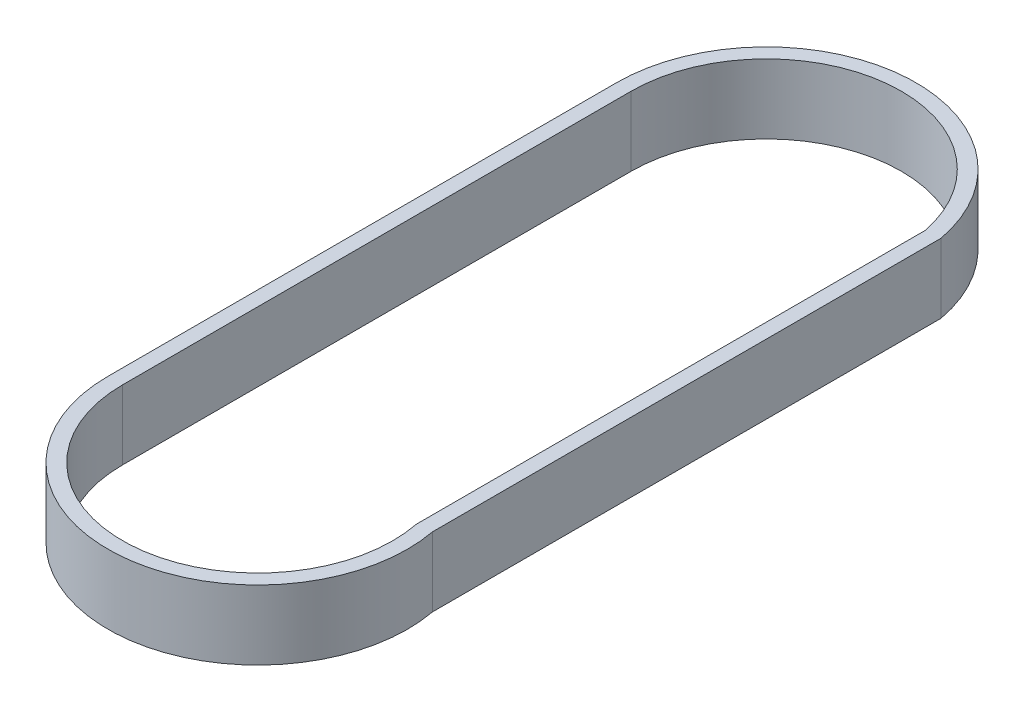
ISO-10303-21;
HEADER;
FILE_DESCRIPTION(('STEP AP214'),'2;1');
FILE_NAME('part.step','',(''),(''),'','','');
FILE_SCHEMA(('AUTOMOTIVE_DESIGN { 1 0 10303 214 1 1 1 1 }'));
ENDSEC;
DATA;
#1=APPLICATION_CONTEXT('core data for automotive mechanical design processes');
#2=APPLICATION_PROTOCOL_DEFINITION('international standard','automotive_design',2000,#1);
#3=PRODUCT_CONTEXT('',#1,'mechanical');
#4=PRODUCT('Part','Part','',(#3));
#5=PRODUCT_RELATED_PRODUCT_CATEGORY('part','',(#4));
#6=PRODUCT_DEFINITION_FORMATION('','',#4);
#7=PRODUCT_DEFINITION_CONTEXT('part definition',#1,'design');
#8=PRODUCT_DEFINITION('design','',#6,#7);
#9=PRODUCT_DEFINITION_SHAPE('','',#8);
#10=(LENGTH_UNIT() NAMED_UNIT(*) SI_UNIT(.MILLI.,.METRE.));
#11=(NAMED_UNIT(*) PLANE_ANGLE_UNIT() SI_UNIT($,.RADIAN.));
#12=(NAMED_UNIT(*) SI_UNIT($,.STERADIAN.) SOLID_ANGLE_UNIT());
#13=UNCERTAINTY_MEASURE_WITH_UNIT(LENGTH_MEASURE(1.E-05),#10,'distance_accuracy_value','');
#14=(GEOMETRIC_REPRESENTATION_CONTEXT(3) GLOBAL_UNCERTAINTY_ASSIGNED_CONTEXT((#13)) GLOBAL_UNIT_ASSIGNED_CONTEXT((#10,
#11,#12)) REPRESENTATION_CONTEXT('',''));
#15=CARTESIAN_POINT('',(0.,0.,0.));
#16=DIRECTION('',(0.,0.,1.));
#17=DIRECTION('',(1.,0.,0.));
#18=AXIS2_PLACEMENT_3D('',#15,#16,#17);
#19=CARTESIAN_POINT('',(29.21,14.9999954,-52.0819655760116));
#20=DIRECTION('',(0.,-1.,0.));
#21=DIRECTION('',(0.,0.,-1.));
#22=AXIS2_PLACEMENT_3D('',#19,#20,#21);
#23=PLANE('',#22);
#24=CARTESIAN_POINT('',(29.21,14.9999954,-52.0819655760116));
#25=DIRECTION('',(0.,1.,0.));
#26=DIRECTION('',(0.,0.,-1.));
#27=AXIS2_PLACEMENT_3D('',#24,#25,#26);
#28=CIRCLE('',#27,32.385);
#29=CARTESIAN_POINT('',(61.0426573662629,14.9999954,-58.037647736949));
#30=VERTEX_POINT('',#29);
#31=CARTESIAN_POINT('',(-3.175,14.9999954,-52.0819655760116));
#32=VERTEX_POINT('',#31);
#33=EDGE_CURVE('E138',#30,#32,#28,.T.);
#34=ORIENTED_EDGE('',*,*,#33,.T.);
#35=DIRECTION('',(0.,0.,1.));
#36=VECTOR('',#35,1.);
#37=CARTESIAN_POINT('',(-3.175,14.9999954,-52.0819655760116));
#38=LINE('',#37,#36);
#39=CARTESIAN_POINT('',(-3.17499999999999,14.9999954,57.9000344239884));
#40=VERTEX_POINT('',#39);
#41=EDGE_CURVE('E141',#32,#40,#38,.T.);
#42=ORIENTED_EDGE('',*,*,#41,.T.);
#43=CARTESIAN_POINT('',(29.21,14.9999954,57.9000344239884));
#44=DIRECTION('',(0.,1.,0.));
#45=DIRECTION('',(0.,0.,1.));
#46=AXIS2_PLACEMENT_3D('',#43,#44,#45);
#47=CIRCLE('',#46,32.385);
#48=CARTESIAN_POINT('',(61.0426573662629,14.9999954,51.9443522630509));
#49=VERTEX_POINT('',#48);
#50=EDGE_CURVE('E144',#40,#49,#47,.T.);
#51=ORIENTED_EDGE('',*,*,#50,.T.);
#52=DIRECTION('',(0.,0.,-1.));
#53=VECTOR('',#52,1.);
#54=CARTESIAN_POINT('',(61.0426573662629,14.9999954,51.9443522630509));
#55=LINE('',#54,#53);
#56=EDGE_CURVE('E146',#49,#30,#55,.T.);
#57=ORIENTED_EDGE('',*,*,#56,.T.);
#58=EDGE_LOOP('',(#34,#42,#51,#57));
#59=FACE_BOUND('',#58,.T.);
#60=CARTESIAN_POINT('',(29.21,14.9999954,-52.0819655760116));
#61=DIRECTION('',(0.,1.,0.));
#62=DIRECTION('',(0.,0.,-1.));
#63=AXIS2_PLACEMENT_3D('',#60,#61,#62);
#64=CIRCLE('',#63,29.21);
#65=CARTESIAN_POINT('',(57.8676573662629,14.9999954,-57.7355285479681));
#66=VERTEX_POINT('',#65);
#67=CARTESIAN_POINT('',(0.,14.9999954,-52.0819655760116));
#68=VERTEX_POINT('',#67);
#69=EDGE_CURVE('E102',#66,#68,#64,.T.);
#70=ORIENTED_EDGE('',*,*,#69,.F.);
#71=DIRECTION('',(0.,0.,-1.));
#72=VECTOR('',#71,1.);
#73=CARTESIAN_POINT('',(57.8676573662629,14.9999954,52.2464714520319));
#74=LINE('',#73,#72);
#75=CARTESIAN_POINT('',(57.8676573662629,14.9999954,52.2464714520319));
#76=VERTEX_POINT('',#75);
#77=EDGE_CURVE('E124',#76,#66,#74,.T.);
#78=ORIENTED_EDGE('',*,*,#77,.F.);
#79=CARTESIAN_POINT('',(29.21,14.9999954,57.9000344239884));
#80=DIRECTION('',(0.,1.,0.));
#81=DIRECTION('',(0.,0.,1.));
#82=AXIS2_PLACEMENT_3D('',#79,#80,#81);
#83=CIRCLE('',#82,29.21);
#84=CARTESIAN_POINT('',(0.,14.9999954,57.9000344239884));
#85=VERTEX_POINT('',#84);
#86=EDGE_CURVE('E122',#85,#76,#83,.T.);
#87=ORIENTED_EDGE('',*,*,#86,.F.);
#88=DIRECTION('',(0.,0.,1.));
#89=VECTOR('',#88,1.);
#90=CARTESIAN_POINT('',(0.,14.9999954,-52.0819655760116));
#91=LINE('',#90,#89);
#92=EDGE_CURVE('E110',#68,#85,#91,.T.);
#93=ORIENTED_EDGE('',*,*,#92,.F.);
#94=EDGE_LOOP('',(#70,#78,#87,#93));
#95=FACE_BOUND('',#94,.T.);
#96=ADVANCED_FACE('F37',(#59,#95),#23,.F.);
#97=CARTESIAN_POINT('',(29.21,0.,-52.0819655760116));
#98=DIRECTION('',(0.,-1.,0.));
#99=DIRECTION('',(0.,0.,-1.));
#100=AXIS2_PLACEMENT_3D('',#97,#98,#99);
#101=PLANE('',#100);
#102=CARTESIAN_POINT('',(29.21,0.,-52.0819655760116));
#103=DIRECTION('',(0.,1.,0.));
#104=DIRECTION('',(0.,0.,-1.));
#105=AXIS2_PLACEMENT_3D('',#102,#103,#104);
#106=CIRCLE('',#105,32.385);
#107=CARTESIAN_POINT('',(61.0426573662629,0.,-58.037647736949));
#108=VERTEX_POINT('',#107);
#109=CARTESIAN_POINT('',(-3.175,0.,-52.0819655760116));
#110=VERTEX_POINT('',#109);
#111=EDGE_CURVE('E118',#108,#110,#106,.T.);
#112=ORIENTED_EDGE('',*,*,#111,.F.);
#113=DIRECTION('',(0.,0.,-1.));
#114=VECTOR('',#113,1.);
#115=CARTESIAN_POINT('',(61.0426573662629,0.,51.9443522630509));
#116=LINE('',#115,#114);
#117=CARTESIAN_POINT('',(61.0426573662629,0.,51.9443522630509));
#118=VERTEX_POINT('',#117);
#119=EDGE_CURVE('E142',#118,#108,#116,.T.);
#120=ORIENTED_EDGE('',*,*,#119,.F.);
#121=CARTESIAN_POINT('',(29.21,0.,57.9000344239884));
#122=DIRECTION('',(0.,1.,0.));
#123=DIRECTION('',(0.,0.,1.));
#124=AXIS2_PLACEMENT_3D('',#121,#122,#123);
#125=CIRCLE('',#124,32.385);
#126=CARTESIAN_POINT('',(-3.17499999999999,0.,57.9000344239884));
#127=VERTEX_POINT('',#126);
#128=EDGE_CURVE('E153',#127,#118,#125,.T.);
#129=ORIENTED_EDGE('',*,*,#128,.F.);
#130=DIRECTION('',(0.,0.,1.));
#131=VECTOR('',#130,1.);
#132=CARTESIAN_POINT('',(-3.175,0.,-52.0819655760116));
#133=LINE('',#132,#131);
#134=EDGE_CURVE('E151',#110,#127,#133,.T.);
#135=ORIENTED_EDGE('',*,*,#134,.F.);
#136=EDGE_LOOP('',(#112,#120,#129,#135));
#137=FACE_BOUND('',#136,.T.);
#138=DIRECTION('',(0.,0.,-1.));
#139=VECTOR('',#138,1.);
#140=CARTESIAN_POINT('',(57.8676573662629,0.,52.2464714520319));
#141=LINE('',#140,#139);
#142=CARTESIAN_POINT('',(57.8676573662629,0.,52.2464714520319));
#143=VERTEX_POINT('',#142);
#144=CARTESIAN_POINT('',(57.8676573662629,0.,-57.7355285479681));
#145=VERTEX_POINT('',#144);
#146=EDGE_CURVE('E111',#143,#145,#141,.T.);
#147=ORIENTED_EDGE('',*,*,#146,.T.);
#148=CARTESIAN_POINT('',(29.21,0.,-52.0819655760116));
#149=DIRECTION('',(0.,1.,0.));
#150=DIRECTION('',(0.,0.,-1.));
#151=AXIS2_PLACEMENT_3D('',#148,#149,#150);
#152=CIRCLE('',#151,29.21);
#153=CARTESIAN_POINT('',(0.,0.,-52.0819655760116));
#154=VERTEX_POINT('',#153);
#155=EDGE_CURVE('E60',#145,#154,#152,.T.);
#156=ORIENTED_EDGE('',*,*,#155,.T.);
#157=DIRECTION('',(0.,0.,1.));
#158=VECTOR('',#157,1.);
#159=CARTESIAN_POINT('',(0.,0.,-52.0819655760116));
#160=LINE('',#159,#158);
#161=CARTESIAN_POINT('',(0.,0.,57.9000344239884));
#162=VERTEX_POINT('',#161);
#163=EDGE_CURVE('E117',#154,#162,#160,.T.);
#164=ORIENTED_EDGE('',*,*,#163,.T.);
#165=CARTESIAN_POINT('',(29.21,0.,57.9000344239884));
#166=DIRECTION('',(0.,1.,0.));
#167=DIRECTION('',(0.,0.,1.));
#168=AXIS2_PLACEMENT_3D('',#165,#166,#167);
#169=CIRCLE('',#168,29.21);
#170=EDGE_CURVE('E130',#162,#143,#169,.T.);
#171=ORIENTED_EDGE('',*,*,#170,.T.);
#172=EDGE_LOOP('',(#147,#156,#164,#171));
#173=FACE_BOUND('',#172,.T.);
#174=ADVANCED_FACE('F171',(#137,#173),#101,.T.);
#175=CARTESIAN_POINT('',(29.21,14.9999954,-52.0819655760116));
#176=DIRECTION('',(0.,-1.,0.));
#177=DIRECTION('',(0.,0.,-1.));
#178=AXIS2_PLACEMENT_3D('',#175,#176,#177);
#179=CYLINDRICAL_SURFACE('',#178,32.385);
#180=ORIENTED_EDGE('',*,*,#111,.T.);
#181=DIRECTION('',(0.,-1.,0.));
#182=VECTOR('',#181,1.);
#183=CARTESIAN_POINT('',(-3.175,14.9999954,-52.0819655760116));
#184=LINE('',#183,#182);
#185=EDGE_CURVE('E11',#32,#110,#184,.T.);
#186=ORIENTED_EDGE('',*,*,#185,.F.);
#187=ORIENTED_EDGE('',*,*,#33,.F.);
#188=DIRECTION('',(0.,-1.,0.));
#189=VECTOR('',#188,1.);
#190=CARTESIAN_POINT('',(61.0426573662629,14.9999954,-58.037647736949));
#191=LINE('',#190,#189);
#192=EDGE_CURVE('E148',#30,#108,#191,.T.);
#193=ORIENTED_EDGE('',*,*,#192,.T.);
#194=EDGE_LOOP('',(#180,#186,#187,#193));
#195=FACE_BOUND('',#194,.T.);
#196=ADVANCED_FACE('F39',(#195),#179,.T.);
#197=CARTESIAN_POINT('',(-3.175,14.9999954,-52.0819655760116));
#198=DIRECTION('',(1.,0.,0.));
#199=DIRECTION('',(0.,0.,-1.));
#200=AXIS2_PLACEMENT_3D('',#197,#198,#199);
#201=PLANE('',#200);
#202=ORIENTED_EDGE('',*,*,#134,.T.);
#203=DIRECTION('',(0.,-1.,0.));
#204=VECTOR('',#203,1.);
#205=CARTESIAN_POINT('',(-3.17499999999999,14.9999954,57.9000344239884));
#206=LINE('',#205,#204);
#207=EDGE_CURVE('E45',#40,#127,#206,.T.);
#208=ORIENTED_EDGE('',*,*,#207,.F.);
#209=ORIENTED_EDGE('',*,*,#41,.F.);
#210=ORIENTED_EDGE('',*,*,#185,.T.);
#211=EDGE_LOOP('',(#202,#208,#209,#210));
#212=FACE_BOUND('',#211,.T.);
#213=ADVANCED_FACE('F181',(#212),#201,.F.);
#214=CARTESIAN_POINT('',(29.21,14.9999954,57.9000344239884));
#215=DIRECTION('',(0.,-1.,0.));
#216=DIRECTION('',(0.,0.,-1.));
#217=AXIS2_PLACEMENT_3D('',#214,#215,#216);
#218=CYLINDRICAL_SURFACE('',#217,32.385);
#219=ORIENTED_EDGE('',*,*,#128,.T.);
#220=DIRECTION('',(0.,-1.,0.));
#221=VECTOR('',#220,1.);
#222=CARTESIAN_POINT('',(61.0426573662629,14.9999954,51.9443522630509));
#223=LINE('',#222,#221);
#224=EDGE_CURVE('E158',#49,#118,#223,.T.);
#225=ORIENTED_EDGE('',*,*,#224,.F.);
#226=ORIENTED_EDGE('',*,*,#50,.F.);
#227=ORIENTED_EDGE('',*,*,#207,.T.);
#228=EDGE_LOOP('',(#219,#225,#226,#227));
#229=FACE_BOUND('',#228,.T.);
#230=ADVANCED_FACE('F165',(#229),#218,.T.);
#231=CARTESIAN_POINT('',(61.0426573662629,14.9999954,51.9443522630509));
#232=DIRECTION('',(-1.,0.,0.));
#233=DIRECTION('',(0.,0.,1.));
#234=AXIS2_PLACEMENT_3D('',#231,#232,#233);
#235=PLANE('',#234);
#236=ORIENTED_EDGE('',*,*,#119,.T.);
#237=ORIENTED_EDGE('',*,*,#192,.F.);
#238=ORIENTED_EDGE('',*,*,#56,.F.);
#239=ORIENTED_EDGE('',*,*,#224,.T.);
#240=EDGE_LOOP('',(#236,#237,#238,#239));
#241=FACE_BOUND('',#240,.T.);
#242=ADVANCED_FACE('F175',(#241),#235,.F.);
#243=CARTESIAN_POINT('',(29.21,14.9999954,-52.0819655760116));
#244=DIRECTION('',(0.,-1.,0.));
#245=DIRECTION('',(0.,0.,-1.));
#246=AXIS2_PLACEMENT_3D('',#243,#244,#245);
#247=CYLINDRICAL_SURFACE('',#246,29.21);
#248=ORIENTED_EDGE('',*,*,#155,.F.);
#249=DIRECTION('',(0.,-1.,0.));
#250=VECTOR('',#249,1.);
#251=CARTESIAN_POINT('',(57.8676573662629,14.9999954,-57.7355285479681));
#252=LINE('',#251,#250);
#253=EDGE_CURVE('E106',#66,#145,#252,.T.);
#254=ORIENTED_EDGE('',*,*,#253,.F.);
#255=ORIENTED_EDGE('',*,*,#69,.T.);
#256=DIRECTION('',(0.,-1.,0.));
#257=VECTOR('',#256,1.);
#258=CARTESIAN_POINT('',(0.,14.9999954,-52.0819655760116));
#259=LINE('',#258,#257);
#260=EDGE_CURVE('E105',#68,#154,#259,.T.);
#261=ORIENTED_EDGE('',*,*,#260,.T.);
#262=EDGE_LOOP('',(#248,#254,#255,#261));
#263=FACE_BOUND('',#262,.T.);
#264=ADVANCED_FACE('F104',(#263),#247,.F.);
#265=CARTESIAN_POINT('',(0.,14.9999954,-52.0819655760116));
#266=DIRECTION('',(1.,0.,0.));
#267=DIRECTION('',(0.,0.,-1.));
#268=AXIS2_PLACEMENT_3D('',#265,#266,#267);
#269=PLANE('',#268);
#270=ORIENTED_EDGE('',*,*,#163,.F.);
#271=ORIENTED_EDGE('',*,*,#260,.F.);
#272=ORIENTED_EDGE('',*,*,#92,.T.);
#273=DIRECTION('',(0.,-1.,0.));
#274=VECTOR('',#273,1.);
#275=CARTESIAN_POINT('',(0.,14.9999954,57.9000344239884));
#276=LINE('',#275,#274);
#277=EDGE_CURVE('E119',#85,#162,#276,.T.);
#278=ORIENTED_EDGE('',*,*,#277,.T.);
#279=EDGE_LOOP('',(#270,#271,#272,#278));
#280=FACE_BOUND('',#279,.T.);
#281=ADVANCED_FACE('F114',(#280),#269,.T.);
#282=CARTESIAN_POINT('',(29.21,14.9999954,57.9000344239884));
#283=DIRECTION('',(0.,-1.,0.));
#284=DIRECTION('',(0.,0.,-1.));
#285=AXIS2_PLACEMENT_3D('',#282,#283,#284);
#286=CYLINDRICAL_SURFACE('',#285,29.21);
#287=ORIENTED_EDGE('',*,*,#170,.F.);
#288=ORIENTED_EDGE('',*,*,#277,.F.);
#289=ORIENTED_EDGE('',*,*,#86,.T.);
#290=DIRECTION('',(0.,-1.,0.));
#291=VECTOR('',#290,1.);
#292=CARTESIAN_POINT('',(57.8676573662629,14.9999954,52.2464714520319));
#293=LINE('',#292,#291);
#294=EDGE_CURVE('E52',#76,#143,#293,.T.);
#295=ORIENTED_EDGE('',*,*,#294,.T.);
#296=EDGE_LOOP('',(#287,#288,#289,#295));
#297=FACE_BOUND('',#296,.T.);
#298=ADVANCED_FACE('F204',(#297),#286,.F.);
#299=CARTESIAN_POINT('',(57.8676573662629,14.9999954,52.2464714520319));
#300=DIRECTION('',(-1.,0.,0.));
#301=DIRECTION('',(0.,0.,1.));
#302=AXIS2_PLACEMENT_3D('',#299,#300,#301);
#303=PLANE('',#302);
#304=ORIENTED_EDGE('',*,*,#146,.F.);
#305=ORIENTED_EDGE('',*,*,#294,.F.);
#306=ORIENTED_EDGE('',*,*,#77,.T.);
#307=ORIENTED_EDGE('',*,*,#253,.T.);
#308=EDGE_LOOP('',(#304,#305,#306,#307));
#309=FACE_BOUND('',#308,.T.);
#310=ADVANCED_FACE('F208',(#309),#303,.T.);
#311=CLOSED_SHELL('',(#96,#174,#196,#213,#230,#242,#264,#281,#298,#310));
#312=MANIFOLD_SOLID_BREP('B2',#311);
#313=ADVANCED_BREP_SHAPE_REPRESENTATION('',(#18,#312),#14);
#314=SHAPE_DEFINITION_REPRESENTATION(#9,#313);
ENDSEC;
END-ISO-10303-21;
